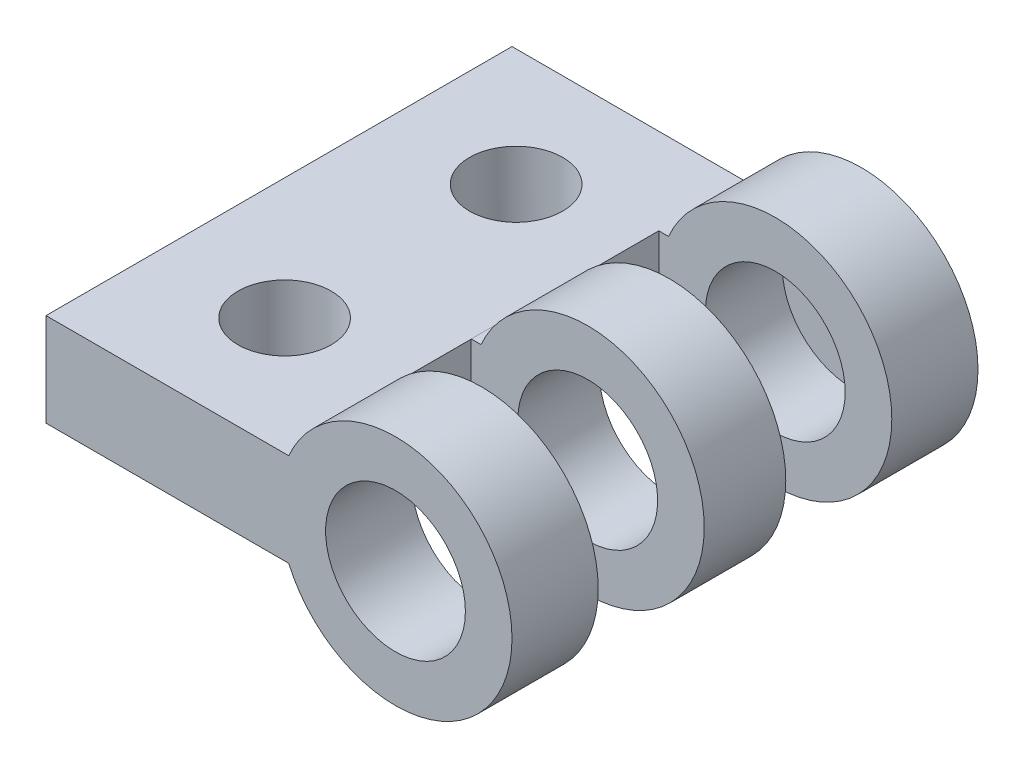
ISO-10303-21;
HEADER;
FILE_DESCRIPTION(('STEP AP214'),'2;1');
FILE_NAME('part.step','',(''),(''),'','','');
FILE_SCHEMA(('AUTOMOTIVE_DESIGN { 1 0 10303 214 1 1 1 1 }'));
ENDSEC;
DATA;
#1=APPLICATION_CONTEXT('core data for automotive mechanical design processes');
#2=APPLICATION_PROTOCOL_DEFINITION('international standard','automotive_design',2000,#1);
#3=PRODUCT_CONTEXT('',#1,'mechanical');
#4=PRODUCT('Part','Part','',(#3));
#5=PRODUCT_RELATED_PRODUCT_CATEGORY('part','',(#4));
#6=PRODUCT_DEFINITION_FORMATION('','',#4);
#7=PRODUCT_DEFINITION_CONTEXT('part definition',#1,'design');
#8=PRODUCT_DEFINITION('design','',#6,#7);
#9=PRODUCT_DEFINITION_SHAPE('','',#8);
#10=(LENGTH_UNIT() NAMED_UNIT(*) SI_UNIT(.MILLI.,.METRE.));
#11=(NAMED_UNIT(*) PLANE_ANGLE_UNIT() SI_UNIT($,.RADIAN.));
#12=(NAMED_UNIT(*) SI_UNIT($,.STERADIAN.) SOLID_ANGLE_UNIT());
#13=UNCERTAINTY_MEASURE_WITH_UNIT(LENGTH_MEASURE(1.E-05),#10,'distance_accuracy_value','');
#14=(GEOMETRIC_REPRESENTATION_CONTEXT(3) GLOBAL_UNCERTAINTY_ASSIGNED_CONTEXT((#13)) GLOBAL_UNIT_ASSIGNED_CONTEXT((#10,
#11,#12)) REPRESENTATION_CONTEXT('',''));
#15=CARTESIAN_POINT('',(0.,0.,0.));
#16=DIRECTION('',(0.,0.,1.));
#17=DIRECTION('',(1.,0.,0.));
#18=AXIS2_PLACEMENT_3D('',#15,#16,#17);
#19=CARTESIAN_POINT('',(0.,0.,1.95));
#20=DIRECTION('',(0.,0.,-1.));
#21=DIRECTION('',(-1.,0.,0.));
#22=AXIS2_PLACEMENT_3D('',#19,#20,#21);
#23=CYLINDRICAL_SURFACE('',#22,2.5);
#24=CARTESIAN_POINT('',(0.,0.,1.85));
#25=DIRECTION('',(0.,0.,1.));
#26=DIRECTION('',(1.,0.,0.));
#27=AXIS2_PLACEMENT_3D('',#24,#25,#26);
#28=CIRCLE('',#27,2.5);
#29=CARTESIAN_POINT('',(-2.29128784747792,-1.,1.85));
#30=VERTEX_POINT('',#29);
#31=CARTESIAN_POINT('',(-2.29128784747792,1.,1.85));
#32=VERTEX_POINT('',#31);
#33=EDGE_CURVE('E156',#30,#32,#28,.T.);
#34=ORIENTED_EDGE('',*,*,#33,.F.);
#35=DIRECTION('',(0.,0.,-1.));
#36=VECTOR('',#35,1.);
#37=CARTESIAN_POINT('',(-2.29128784747792,-1.,1.95));
#38=LINE('',#37,#36);
#39=CARTESIAN_POINT('',(-2.29128784747792,-1.,0.));
#40=VERTEX_POINT('',#39);
#41=EDGE_CURVE('E256',#30,#40,#38,.T.);
#42=ORIENTED_EDGE('',*,*,#41,.T.);
#43=CARTESIAN_POINT('',(0.,0.,0.));
#44=DIRECTION('',(0.,0.,1.));
#45=DIRECTION('',(1.,0.,0.));
#46=AXIS2_PLACEMENT_3D('',#43,#44,#45);
#47=CIRCLE('',#46,2.5);
#48=CARTESIAN_POINT('',(-2.29128784747792,1.,0.));
#49=VERTEX_POINT('',#48);
#50=EDGE_CURVE('E292',#40,#49,#47,.T.);
#51=ORIENTED_EDGE('',*,*,#50,.T.);
#52=DIRECTION('',(0.,0.,-1.));
#53=VECTOR('',#52,1.);
#54=CARTESIAN_POINT('',(-2.29128784747792,1.,1.95));
#55=LINE('',#54,#53);
#56=EDGE_CURVE('E289',#49,#32,#55,.F.);
#57=ORIENTED_EDGE('',*,*,#56,.T.);
#58=EDGE_LOOP('',(#34,#42,#51,#57));
#59=FACE_BOUND('',#58,.T.);
#60=ADVANCED_FACE('F42',(#59),#23,.T.);
#61=CARTESIAN_POINT('',(0.,0.,5.975));
#62=DIRECTION('',(0.,0.,-1.));
#63=DIRECTION('',(-1.,0.,0.));
#64=AXIS2_PLACEMENT_3D('',#61,#62,#63);
#65=CYLINDRICAL_SURFACE('',#64,2.5);
#66=DIRECTION('',(0.,0.,1.));
#67=VECTOR('',#66,1.);
#68=CARTESIAN_POINT('',(-2.29128784747792,-1.,8.05));
#69=LINE('',#68,#67);
#70=CARTESIAN_POINT('',(-2.29128784747792,-1.,4.125));
#71=VERTEX_POINT('',#70);
#72=CARTESIAN_POINT('',(-2.29128784747792,-1.,5.875));
#73=VERTEX_POINT('',#72);
#74=EDGE_CURVE('E253',#71,#73,#69,.T.);
#75=ORIENTED_EDGE('',*,*,#74,.F.);
#76=CARTESIAN_POINT('',(0.,0.,4.125));
#77=DIRECTION('',(0.,0.,1.));
#78=DIRECTION('',(1.,0.,0.));
#79=AXIS2_PLACEMENT_3D('',#76,#77,#78);
#80=CIRCLE('',#79,2.5);
#81=CARTESIAN_POINT('',(-2.29003079221331,1.00287535153422,4.125));
#82=VERTEX_POINT('',#81);
#83=EDGE_CURVE('E172',#82,#71,#80,.F.);
#84=ORIENTED_EDGE('',*,*,#83,.F.);
#85=DIRECTION('',(0.,0.,1.));
#86=VECTOR('',#85,1.);
#87=CARTESIAN_POINT('',(-2.29003079221331,1.00287535153422,8.05));
#88=LINE('',#87,#86);
#89=CARTESIAN_POINT('',(-2.29003079221331,1.00287535153422,5.875));
#90=VERTEX_POINT('',#89);
#91=EDGE_CURVE('E245',#90,#82,#88,.F.);
#92=ORIENTED_EDGE('',*,*,#91,.F.);
#93=CARTESIAN_POINT('',(0.,0.,5.875));
#94=DIRECTION('',(0.,0.,-1.));
#95=DIRECTION('',(-1.,0.,0.));
#96=AXIS2_PLACEMENT_3D('',#93,#94,#95);
#97=CIRCLE('',#96,2.5);
#98=EDGE_CURVE('E188',#73,#90,#97,.F.);
#99=ORIENTED_EDGE('',*,*,#98,.F.);
#100=EDGE_LOOP('',(#75,#84,#92,#99));
#101=FACE_BOUND('',#100,.T.);
#102=ADVANCED_FACE('F330',(#101),#65,.T.);
#103=CARTESIAN_POINT('',(-2.5,-1.,0.));
#104=DIRECTION('',(1.,0.,0.));
#105=DIRECTION('',(0.,0.,-1.));
#106=AXIS2_PLACEMENT_3D('',#103,#104,#105);
#107=PLANE('',#106);
#108=DIRECTION('',(0.,0.,-1.));
#109=VECTOR('',#108,1.);
#110=CARTESIAN_POINT('',(-2.5,1.,0.));
#111=LINE('',#110,#109);
#112=CARTESIAN_POINT('',(-2.5,1.,8.15));
#113=VERTEX_POINT('',#112);
#114=CARTESIAN_POINT('',(-2.5,1.,5.875));
#115=VERTEX_POINT('',#114);
#116=EDGE_CURVE('E149',#113,#115,#111,.T.);
#117=ORIENTED_EDGE('',*,*,#116,.F.);
#118=DIRECTION('',(0.,1.,0.));
#119=VECTOR('',#118,1.);
#120=CARTESIAN_POINT('',(-2.5,2.74000558746575,8.15));
#121=LINE('',#120,#119);
#122=CARTESIAN_POINT('',(-2.5,-1.,8.15));
#123=VERTEX_POINT('',#122);
#124=EDGE_CURVE('E199',#123,#113,#121,.T.);
#125=ORIENTED_EDGE('',*,*,#124,.F.);
#126=DIRECTION('',(0.,0.,-1.));
#127=VECTOR('',#126,1.);
#128=CARTESIAN_POINT('',(-2.5,-1.,0.));
#129=LINE('',#128,#127);
#130=CARTESIAN_POINT('',(-2.5,-1.,5.875));
#131=VERTEX_POINT('',#130);
#132=EDGE_CURVE('E274',#123,#131,#129,.T.);
#133=ORIENTED_EDGE('',*,*,#132,.T.);
#134=DIRECTION('',(0.,-1.,0.));
#135=VECTOR('',#134,1.);
#136=CARTESIAN_POINT('',(-2.5,2.60546008413663,5.875));
#137=LINE('',#136,#135);
#138=EDGE_CURVE('E183',#115,#131,#137,.T.);
#139=ORIENTED_EDGE('',*,*,#138,.F.);
#140=EDGE_LOOP('',(#117,#125,#133,#139));
#141=FACE_BOUND('',#140,.T.);
#142=ADVANCED_FACE('F342',(#141),#107,.T.);
#143=CARTESIAN_POINT('',(0.,0.,8.05));
#144=DIRECTION('',(0.,0.,1.));
#145=DIRECTION('',(1.,0.,0.));
#146=AXIS2_PLACEMENT_3D('',#143,#144,#145);
#147=CYLINDRICAL_SURFACE('',#146,2.5);
#148=CARTESIAN_POINT('',(0.,0.,8.15));
#149=DIRECTION('',(0.,0.,1.));
#150=DIRECTION('',(1.,0.,0.));
#151=AXIS2_PLACEMENT_3D('',#148,#149,#150);
#152=CIRCLE('',#151,2.5);
#153=CARTESIAN_POINT('',(-2.29128784747792,1.,8.15));
#154=VERTEX_POINT('',#153);
#155=CARTESIAN_POINT('',(-2.29128784747792,-1.,8.15));
#156=VERTEX_POINT('',#155);
#157=EDGE_CURVE('E208',#154,#156,#152,.F.);
#158=ORIENTED_EDGE('',*,*,#157,.F.);
#159=DIRECTION('',(0.,0.,1.));
#160=VECTOR('',#159,1.);
#161=CARTESIAN_POINT('',(-2.29128784747792,1.,8.05));
#162=LINE('',#161,#160);
#163=CARTESIAN_POINT('',(-2.29128784747792,1.,10.));
#164=VERTEX_POINT('',#163);
#165=EDGE_CURVE('E228',#164,#154,#162,.F.);
#166=ORIENTED_EDGE('',*,*,#165,.F.);
#167=CARTESIAN_POINT('',(0.,0.,10.));
#168=DIRECTION('',(0.,0.,1.));
#169=DIRECTION('',(1.,0.,0.));
#170=AXIS2_PLACEMENT_3D('',#167,#168,#169);
#171=CIRCLE('',#170,2.5);
#172=CARTESIAN_POINT('',(-2.29128784747792,-1.,10.));
#173=VERTEX_POINT('',#172);
#174=EDGE_CURVE('E237',#173,#164,#171,.T.);
#175=ORIENTED_EDGE('',*,*,#174,.F.);
#176=DIRECTION('',(0.,0.,1.));
#177=VECTOR('',#176,1.);
#178=CARTESIAN_POINT('',(-2.29128784747792,-1.,8.05));
#179=LINE('',#178,#177);
#180=EDGE_CURVE('E241',#156,#173,#179,.T.);
#181=ORIENTED_EDGE('',*,*,#180,.F.);
#182=EDGE_LOOP('',(#158,#166,#175,#181));
#183=FACE_BOUND('',#182,.T.);
#184=ADVANCED_FACE('F347',(#183),#147,.T.);
#185=CARTESIAN_POINT('',(-2.5,1.,4.125));
#186=VERTEX_POINT('',#185);
#187=CARTESIAN_POINT('',(-2.5,1.,1.85));
#188=VERTEX_POINT('',#187);
#189=EDGE_CURVE('E140',#186,#188,#111,.T.);
#190=ORIENTED_EDGE('',*,*,#189,.F.);
#191=DIRECTION('',(0.,1.,0.));
#192=VECTOR('',#191,1.);
#193=CARTESIAN_POINT('',(-2.5,2.5,4.125));
#194=LINE('',#193,#192);
#195=CARTESIAN_POINT('',(-2.5,-1.,4.125));
#196=VERTEX_POINT('',#195);
#197=EDGE_CURVE('E171',#196,#186,#194,.T.);
#198=ORIENTED_EDGE('',*,*,#197,.F.);
#199=CARTESIAN_POINT('',(-2.5,-1.,1.85));
#200=VERTEX_POINT('',#199);
#201=EDGE_CURVE('E57',#196,#200,#129,.T.);
#202=ORIENTED_EDGE('',*,*,#201,.T.);
#203=DIRECTION('',(0.,-1.,0.));
#204=VECTOR('',#203,1.);
#205=CARTESIAN_POINT('',(-2.5,2.76258699038665,1.85));
#206=LINE('',#205,#204);
#207=EDGE_CURVE('E154',#188,#200,#206,.T.);
#208=ORIENTED_EDGE('',*,*,#207,.F.);
#209=EDGE_LOOP('',(#190,#198,#202,#208));
#210=FACE_BOUND('',#209,.T.);
#211=ADVANCED_FACE('F160',(#210),#107,.T.);
#212=CARTESIAN_POINT('',(0.,0.,0.));
#213=DIRECTION('',(0.,0.,1.));
#214=DIRECTION('',(1.,0.,0.));
#215=AXIS2_PLACEMENT_3D('',#212,#213,#214);
#216=PLANE('',#215);
#217=ORIENTED_EDGE('',*,*,#50,.F.);
#218=DIRECTION('',(-1.,0.,0.));
#219=VECTOR('',#218,1.);
#220=CARTESIAN_POINT('',(-7.5,-1.,0.));
#221=LINE('',#220,#219);
#222=CARTESIAN_POINT('',(-7.5,-1.,0.));
#223=VERTEX_POINT('',#222);
#224=EDGE_CURVE('E277',#40,#223,#221,.T.);
#225=ORIENTED_EDGE('',*,*,#224,.T.);
#226=DIRECTION('',(0.,1.,0.));
#227=VECTOR('',#226,1.);
#228=CARTESIAN_POINT('',(-7.5,-1.,0.));
#229=LINE('',#228,#227);
#230=CARTESIAN_POINT('',(-7.5,1.,0.));
#231=VERTEX_POINT('',#230);
#232=EDGE_CURVE('E282',#223,#231,#229,.T.);
#233=ORIENTED_EDGE('',*,*,#232,.T.);
#234=DIRECTION('',(-1.,0.,0.));
#235=VECTOR('',#234,1.);
#236=CARTESIAN_POINT('',(2.501,1.,0.));
#237=LINE('',#236,#235);
#238=EDGE_CURVE('E286',#49,#231,#237,.T.);
#239=ORIENTED_EDGE('',*,*,#238,.F.);
#240=EDGE_LOOP('',(#217,#225,#233,#239));
#241=FACE_BOUND('',#240,.T.);
#242=ADVANCED_FACE('F360',(#241),#216,.F.);
#243=CARTESIAN_POINT('',(2.501,1.,1.95));
#244=DIRECTION('',(0.,-1.,0.));
#245=DIRECTION('',(0.,0.,-1.));
#246=AXIS2_PLACEMENT_3D('',#243,#244,#245);
#247=PLANE('',#246);
#248=CARTESIAN_POINT('',(-4.89564392373896,1.,7.48422319895814));
#249=DIRECTION('',(0.,1.,0.));
#250=DIRECTION('',(0.,0.,1.));
#251=AXIS2_PLACEMENT_3D('',#248,#249,#250);
#252=CIRCLE('',#251,1.);
#253=CARTESIAN_POINT('',(-4.89564392373896,1.,8.48422319895814));
#254=VERTEX_POINT('',#253);
#255=EDGE_CURVE('E216',#254,#254,#252,.T.);
#256=ORIENTED_EDGE('',*,*,#255,.F.);
#257=EDGE_LOOP('',(#256));
#258=FACE_BOUND('',#257,.T.);
#259=CARTESIAN_POINT('',(-4.89564392373896,1.,2.51577680104186));
#260=DIRECTION('',(0.,1.,0.));
#261=DIRECTION('',(0.,0.,-1.));
#262=AXIS2_PLACEMENT_3D('',#259,#260,#261);
#263=CIRCLE('',#262,1.);
#264=CARTESIAN_POINT('',(-4.89564392373896,1.,1.51577680104186));
#265=VERTEX_POINT('',#264);
#266=EDGE_CURVE('E215',#265,#265,#263,.T.);
#267=ORIENTED_EDGE('',*,*,#266,.F.);
#268=EDGE_LOOP('',(#267));
#269=FACE_BOUND('',#268,.T.);
#270=ORIENTED_EDGE('',*,*,#189,.T.);
#271=DIRECTION('',(-1.,0.,0.));
#272=VECTOR('',#271,1.);
#273=CARTESIAN_POINT('',(2.501,1.,1.85));
#274=LINE('',#273,#272);
#275=EDGE_CURVE('E144',#32,#188,#274,.T.);
#276=ORIENTED_EDGE('',*,*,#275,.F.);
#277=ORIENTED_EDGE('',*,*,#56,.F.);
#278=ORIENTED_EDGE('',*,*,#238,.T.);
#279=DIRECTION('',(0.,0.,1.));
#280=VECTOR('',#279,1.);
#281=CARTESIAN_POINT('',(-7.5,1.,0.));
#282=LINE('',#281,#280);
#283=CARTESIAN_POINT('',(-7.5,1.,10.));
#284=VERTEX_POINT('',#283);
#285=EDGE_CURVE('E259',#231,#284,#282,.T.);
#286=ORIENTED_EDGE('',*,*,#285,.T.);
#287=DIRECTION('',(1.,0.,0.));
#288=VECTOR('',#287,1.);
#289=CARTESIAN_POINT('',(-7.5,1.,10.));
#290=LINE('',#289,#288);
#291=EDGE_CURVE('E150',#284,#164,#290,.T.);
#292=ORIENTED_EDGE('',*,*,#291,.T.);
#293=ORIENTED_EDGE('',*,*,#165,.T.);
#294=DIRECTION('',(-1.,0.,0.));
#295=VECTOR('',#294,1.);
#296=CARTESIAN_POINT('',(2.501,1.,8.15));
#297=LINE('',#296,#295);
#298=EDGE_CURVE('E211',#154,#113,#297,.T.);
#299=ORIENTED_EDGE('',*,*,#298,.T.);
#300=ORIENTED_EDGE('',*,*,#116,.T.);
#301=DIRECTION('',(0.,0.,1.));
#302=VECTOR('',#301,1.);
#303=CARTESIAN_POINT('',(-2.5,1.,1.95));
#304=LINE('',#303,#302);
#305=EDGE_CURVE('E147',#186,#115,#304,.T.);
#306=ORIENTED_EDGE('',*,*,#305,.F.);
#307=EDGE_LOOP('',(#270,#276,#277,#278,#286,#292,#293,#299,#300,#306));
#308=FACE_BOUND('',#307,.T.);
#309=ADVANCED_FACE('F142',(#258,#269,#308),#247,.F.);
#310=CARTESIAN_POINT('',(-7.5,-1.,0.));
#311=DIRECTION('',(-1.,0.,0.));
#312=DIRECTION('',(0.,0.,1.));
#313=AXIS2_PLACEMENT_3D('',#310,#311,#312);
#314=PLANE('',#313);
#315=DIRECTION('',(0.,1.,0.));
#316=VECTOR('',#315,1.);
#317=CARTESIAN_POINT('',(-7.5,-1.,10.));
#318=LINE('',#317,#316);
#319=CARTESIAN_POINT('',(-7.5,-1.,10.));
#320=VERTEX_POINT('',#319);
#321=EDGE_CURVE('E281',#320,#284,#318,.T.);
#322=ORIENTED_EDGE('',*,*,#321,.T.);
#323=ORIENTED_EDGE('',*,*,#285,.F.);
#324=ORIENTED_EDGE('',*,*,#232,.F.);
#325=DIRECTION('',(0.,0.,1.));
#326=VECTOR('',#325,1.);
#327=CARTESIAN_POINT('',(-7.5,-1.,0.));
#328=LINE('',#327,#326);
#329=EDGE_CURVE('E266',#223,#320,#328,.T.);
#330=ORIENTED_EDGE('',*,*,#329,.T.);
#331=EDGE_LOOP('',(#322,#323,#324,#330));
#332=FACE_BOUND('',#331,.T.);
#333=ADVANCED_FACE('F355',(#332),#314,.T.);
#334=CARTESIAN_POINT('',(-7.5,-1.,10.));
#335=DIRECTION('',(0.,0.,1.));
#336=DIRECTION('',(1.,0.,0.));
#337=AXIS2_PLACEMENT_3D('',#334,#335,#336);
#338=PLANE('',#337);
#339=ORIENTED_EDGE('',*,*,#174,.T.);
#340=ORIENTED_EDGE('',*,*,#291,.F.);
#341=ORIENTED_EDGE('',*,*,#321,.F.);
#342=DIRECTION('',(1.,0.,0.));
#343=VECTOR('',#342,1.);
#344=CARTESIAN_POINT('',(-7.5,-1.,10.));
#345=LINE('',#344,#343);
#346=EDGE_CURVE('E270',#320,#173,#345,.T.);
#347=ORIENTED_EDGE('',*,*,#346,.T.);
#348=EDGE_LOOP('',(#339,#340,#341,#347));
#349=FACE_BOUND('',#348,.T.);
#350=CARTESIAN_POINT('',(0.,0.,10.));
#351=DIRECTION('',(0.,0.,1.));
#352=DIRECTION('',(1.,0.,0.));
#353=AXIS2_PLACEMENT_3D('',#350,#351,#352);
#354=CIRCLE('',#353,1.5);
#355=CARTESIAN_POINT('',(1.5,0.,10.));
#356=VERTEX_POINT('',#355);
#357=EDGE_CURVE('E233',#356,#356,#354,.T.);
#358=ORIENTED_EDGE('',*,*,#357,.F.);
#359=EDGE_LOOP('',(#358));
#360=FACE_BOUND('',#359,.T.);
#361=ADVANCED_FACE('F349',(#349,#360),#338,.T.);
#362=CARTESIAN_POINT('',(0.,-1.,0.));
#363=DIRECTION('',(0.,1.,0.));
#364=DIRECTION('',(0.,0.,1.));
#365=AXIS2_PLACEMENT_3D('',#362,#363,#364);
#366=PLANE('',#365);
#367=CARTESIAN_POINT('',(-4.89564392373896,-1.,7.48422319895814));
#368=DIRECTION('',(0.,1.,0.));
#369=DIRECTION('',(0.,0.,1.));
#370=AXIS2_PLACEMENT_3D('',#367,#368,#369);
#371=CIRCLE('',#370,1.);
#372=CARTESIAN_POINT('',(-4.89564392373896,-1.,8.48422319895814));
#373=VERTEX_POINT('',#372);
#374=EDGE_CURVE('E229',#373,#373,#371,.T.);
#375=ORIENTED_EDGE('',*,*,#374,.T.);
#376=EDGE_LOOP('',(#375));
#377=FACE_BOUND('',#376,.T.);
#378=CARTESIAN_POINT('',(-4.89564392373896,-1.,2.51577680104186));
#379=DIRECTION('',(0.,1.,0.));
#380=DIRECTION('',(0.,0.,1.));
#381=AXIS2_PLACEMENT_3D('',#378,#379,#380);
#382=CIRCLE('',#381,1.);
#383=CARTESIAN_POINT('',(-4.89564392373896,-1.,3.51577680104186));
#384=VERTEX_POINT('',#383);
#385=EDGE_CURVE('E220',#384,#384,#382,.T.);
#386=ORIENTED_EDGE('',*,*,#385,.T.);
#387=EDGE_LOOP('',(#386));
#388=FACE_BOUND('',#387,.T.);
#389=DIRECTION('',(1.,0.,0.));
#390=VECTOR('',#389,1.);
#391=CARTESIAN_POINT('',(0.,-1.,1.85));
#392=LINE('',#391,#390);
#393=EDGE_CURVE('E11',#200,#30,#392,.T.);
#394=ORIENTED_EDGE('',*,*,#393,.F.);
#395=ORIENTED_EDGE('',*,*,#201,.F.);
#396=DIRECTION('',(1.,0.,0.));
#397=VECTOR('',#396,1.);
#398=CARTESIAN_POINT('',(0.,-1.,4.125));
#399=LINE('',#398,#397);
#400=EDGE_CURVE('E175',#196,#71,#399,.T.);
#401=ORIENTED_EDGE('',*,*,#400,.T.);
#402=ORIENTED_EDGE('',*,*,#74,.T.);
#403=DIRECTION('',(-1.,0.,0.));
#404=VECTOR('',#403,1.);
#405=CARTESIAN_POINT('',(0.,-1.,5.875));
#406=LINE('',#405,#404);
#407=EDGE_CURVE('E191',#73,#131,#406,.T.);
#408=ORIENTED_EDGE('',*,*,#407,.T.);
#409=ORIENTED_EDGE('',*,*,#132,.F.);
#410=DIRECTION('',(1.,0.,0.));
#411=VECTOR('',#410,1.);
#412=CARTESIAN_POINT('',(0.,-1.,8.15));
#413=LINE('',#412,#411);
#414=EDGE_CURVE('E204',#123,#156,#413,.T.);
#415=ORIENTED_EDGE('',*,*,#414,.T.);
#416=ORIENTED_EDGE('',*,*,#180,.T.);
#417=ORIENTED_EDGE('',*,*,#346,.F.);
#418=ORIENTED_EDGE('',*,*,#329,.F.);
#419=ORIENTED_EDGE('',*,*,#224,.F.);
#420=ORIENTED_EDGE('',*,*,#41,.F.);
#421=EDGE_LOOP('',(#394,#395,#401,#402,#408,#409,#415,#416,#417,#418,#419,#420));
#422=FACE_BOUND('',#421,.T.);
#423=ADVANCED_FACE('F327',(#377,#388,#422),#366,.F.);
#424=CARTESIAN_POINT('',(0.,0.,5.975));
#425=DIRECTION('',(0.,0.,-1.));
#426=DIRECTION('',(-1.,0.,0.));
#427=AXIS2_PLACEMENT_3D('',#424,#425,#426);
#428=CYLINDRICAL_SURFACE('',#427,1.5);
#429=CARTESIAN_POINT('',(0.,0.,4.125));
#430=DIRECTION('',(0.,0.,1.));
#431=DIRECTION('',(1.,0.,0.));
#432=AXIS2_PLACEMENT_3D('',#429,#430,#431);
#433=CIRCLE('',#432,1.5);
#434=CARTESIAN_POINT('',(1.5,0.,4.125));
#435=VERTEX_POINT('',#434);
#436=EDGE_CURVE('E179',#435,#435,#433,.F.);
#437=ORIENTED_EDGE('',*,*,#436,.T.);
#438=EDGE_LOOP('',(#437));
#439=FACE_BOUND('',#438,.T.);
#440=CARTESIAN_POINT('',(0.,0.,5.875));
#441=DIRECTION('',(0.,0.,-1.));
#442=DIRECTION('',(-1.,0.,0.));
#443=AXIS2_PLACEMENT_3D('',#440,#441,#442);
#444=CIRCLE('',#443,1.5);
#445=CARTESIAN_POINT('',(-1.5,0.,5.875));
#446=VERTEX_POINT('',#445);
#447=EDGE_CURVE('E195',#446,#446,#444,.F.);
#448=ORIENTED_EDGE('',*,*,#447,.T.);
#449=EDGE_LOOP('',(#448));
#450=FACE_BOUND('',#449,.T.);
#451=ADVANCED_FACE('F378',(#439,#450),#428,.F.);
#452=CARTESIAN_POINT('',(-2.5,0.,0.));
#453=DIRECTION('',(1.,0.,0.));
#454=DIRECTION('',(0.,0.,-1.));
#455=AXIS2_PLACEMENT_3D('',#452,#453,#454);
#456=PLANE('',#455);
#457=DIRECTION('',(0.,0.,1.));
#458=VECTOR('',#457,1.);
#459=CARTESIAN_POINT('',(-2.5,1.00287535153422,5.975));
#460=LINE('',#459,#458);
#461=CARTESIAN_POINT('',(-2.5,1.00287535153422,4.125));
#462=VERTEX_POINT('',#461);
#463=CARTESIAN_POINT('',(-2.5,1.00287535153422,5.875));
#464=VERTEX_POINT('',#463);
#465=EDGE_CURVE('E244',#462,#464,#460,.T.);
#466=ORIENTED_EDGE('',*,*,#465,.F.);
#467=EDGE_CURVE('E65',#186,#462,#194,.T.);
#468=ORIENTED_EDGE('',*,*,#467,.F.);
#469=ORIENTED_EDGE('',*,*,#305,.T.);
#470=EDGE_CURVE('E187',#464,#115,#137,.T.);
#471=ORIENTED_EDGE('',*,*,#470,.F.);
#472=EDGE_LOOP('',(#466,#468,#469,#471));
#473=FACE_BOUND('',#472,.T.);
#474=ADVANCED_FACE('F317',(#473),#456,.F.);
#475=CARTESIAN_POINT('',(2.501,1.00287535153422,5.975));
#476=DIRECTION('',(0.,-1.,0.));
#477=DIRECTION('',(0.,0.,-1.));
#478=AXIS2_PLACEMENT_3D('',#475,#476,#477);
#479=PLANE('',#478);
#480=ORIENTED_EDGE('',*,*,#91,.T.);
#481=DIRECTION('',(-1.,0.,0.));
#482=VECTOR('',#481,1.);
#483=CARTESIAN_POINT('',(2.501,1.00287535153422,4.125));
#484=LINE('',#483,#482);
#485=EDGE_CURVE('E50',#82,#462,#484,.T.);
#486=ORIENTED_EDGE('',*,*,#485,.T.);
#487=ORIENTED_EDGE('',*,*,#465,.T.);
#488=DIRECTION('',(1.,0.,0.));
#489=VECTOR('',#488,1.);
#490=CARTESIAN_POINT('',(2.501,1.00287535153422,5.875));
#491=LINE('',#490,#489);
#492=EDGE_CURVE('E297',#464,#90,#491,.T.);
#493=ORIENTED_EDGE('',*,*,#492,.T.);
#494=EDGE_LOOP('',(#480,#486,#487,#493));
#495=FACE_BOUND('',#494,.T.);
#496=ADVANCED_FACE('F312',(#495),#479,.F.);
#497=CARTESIAN_POINT('',(0.,0.,8.05));
#498=DIRECTION('',(0.,0.,1.));
#499=DIRECTION('',(1.,0.,0.));
#500=AXIS2_PLACEMENT_3D('',#497,#498,#499);
#501=CYLINDRICAL_SURFACE('',#500,1.5);
#502=CARTESIAN_POINT('',(0.,0.,8.15));
#503=DIRECTION('',(0.,0.,1.));
#504=DIRECTION('',(1.,0.,0.));
#505=AXIS2_PLACEMENT_3D('',#502,#503,#504);
#506=CIRCLE('',#505,1.5);
#507=CARTESIAN_POINT('',(1.5,0.,8.15));
#508=VERTEX_POINT('',#507);
#509=EDGE_CURVE('E203',#508,#508,#506,.F.);
#510=ORIENTED_EDGE('',*,*,#509,.T.);
#511=EDGE_LOOP('',(#510));
#512=FACE_BOUND('',#511,.T.);
#513=ORIENTED_EDGE('',*,*,#357,.T.);
#514=EDGE_LOOP('',(#513));
#515=FACE_BOUND('',#514,.T.);
#516=ADVANCED_FACE('F453',(#512,#515),#501,.F.);
#517=CARTESIAN_POINT('',(-4.89564392373896,-9.,2.51577680104186));
#518=DIRECTION('',(0.,1.,0.));
#519=DIRECTION('',(0.,0.,1.));
#520=AXIS2_PLACEMENT_3D('',#517,#518,#519);
#521=CYLINDRICAL_SURFACE('',#520,1.);
#522=ORIENTED_EDGE('',*,*,#266,.T.);
#523=EDGE_LOOP('',(#522));
#524=FACE_BOUND('',#523,.T.);
#525=ORIENTED_EDGE('',*,*,#385,.F.);
#526=EDGE_LOOP('',(#525));
#527=FACE_BOUND('',#526,.T.);
#528=ADVANCED_FACE('F462',(#524,#527),#521,.F.);
#529=CARTESIAN_POINT('',(-4.89564392373896,-9.,7.48422319895814));
#530=DIRECTION('',(0.,1.,0.));
#531=DIRECTION('',(0.,0.,1.));
#532=AXIS2_PLACEMENT_3D('',#529,#530,#531);
#533=CYLINDRICAL_SURFACE('',#532,1.);
#534=ORIENTED_EDGE('',*,*,#255,.T.);
#535=EDGE_LOOP('',(#534));
#536=FACE_BOUND('',#535,.T.);
#537=ORIENTED_EDGE('',*,*,#374,.F.);
#538=EDGE_LOOP('',(#537));
#539=FACE_BOUND('',#538,.T.);
#540=ADVANCED_FACE('F479',(#536,#539),#533,.F.);
#541=CARTESIAN_POINT('',(0.,0.,8.15));
#542=DIRECTION('',(0.,0.,1.));
#543=DIRECTION('',(1.,0.,0.));
#544=AXIS2_PLACEMENT_3D('',#541,#542,#543);
#545=PLANE('',#544);
#546=ORIENTED_EDGE('',*,*,#509,.F.);
#547=EDGE_LOOP('',(#546));
#548=FACE_BOUND('',#547,.T.);
#549=ORIENTED_EDGE('',*,*,#298,.F.);
#550=ORIENTED_EDGE('',*,*,#157,.T.);
#551=ORIENTED_EDGE('',*,*,#414,.F.);
#552=ORIENTED_EDGE('',*,*,#124,.T.);
#553=EDGE_LOOP('',(#549,#550,#551,#552));
#554=FACE_BOUND('',#553,.T.);
#555=ADVANCED_FACE('F341',(#548,#554),#545,.F.);
#556=CARTESIAN_POINT('',(0.,0.,5.875));
#557=DIRECTION('',(0.,0.,-1.));
#558=DIRECTION('',(-1.,0.,0.));
#559=AXIS2_PLACEMENT_3D('',#556,#557,#558);
#560=PLANE('',#559);
#561=ORIENTED_EDGE('',*,*,#407,.F.);
#562=ORIENTED_EDGE('',*,*,#98,.T.);
#563=ORIENTED_EDGE('',*,*,#492,.F.);
#564=ORIENTED_EDGE('',*,*,#470,.T.);
#565=ORIENTED_EDGE('',*,*,#138,.T.);
#566=EDGE_LOOP('',(#561,#562,#563,#564,#565));
#567=FACE_BOUND('',#566,.T.);
#568=ORIENTED_EDGE('',*,*,#447,.F.);
#569=EDGE_LOOP('',(#568));
#570=FACE_BOUND('',#569,.T.);
#571=ADVANCED_FACE('F332',(#567,#570),#560,.F.);
#572=CARTESIAN_POINT('',(0.,0.,4.125));
#573=DIRECTION('',(0.,0.,1.));
#574=DIRECTION('',(1.,0.,0.));
#575=AXIS2_PLACEMENT_3D('',#572,#573,#574);
#576=PLANE('',#575);
#577=ORIENTED_EDGE('',*,*,#197,.T.);
#578=ORIENTED_EDGE('',*,*,#467,.T.);
#579=ORIENTED_EDGE('',*,*,#485,.F.);
#580=ORIENTED_EDGE('',*,*,#83,.T.);
#581=ORIENTED_EDGE('',*,*,#400,.F.);
#582=EDGE_LOOP('',(#577,#578,#579,#580,#581));
#583=FACE_BOUND('',#582,.T.);
#584=ORIENTED_EDGE('',*,*,#436,.F.);
#585=EDGE_LOOP('',(#584));
#586=FACE_BOUND('',#585,.T.);
#587=ADVANCED_FACE('F323',(#583,#586),#576,.F.);
#588=CARTESIAN_POINT('',(0.,0.,1.85));
#589=DIRECTION('',(0.,0.,1.));
#590=DIRECTION('',(1.,0.,0.));
#591=AXIS2_PLACEMENT_3D('',#588,#589,#590);
#592=PLANE('',#591);
#593=CARTESIAN_POINT('',(0.,0.,1.85));
#594=DIRECTION('',(0.,0.,1.));
#595=DIRECTION('',(1.,0.,0.));
#596=AXIS2_PLACEMENT_3D('',#593,#594,#595);
#597=CIRCLE('',#596,1.5);
#598=CARTESIAN_POINT('',(1.5,0.,1.85));
#599=VERTEX_POINT('',#598);
#600=EDGE_CURVE('E158',#599,#599,#597,.T.);
#601=ORIENTED_EDGE('',*,*,#600,.F.);
#602=EDGE_LOOP('',(#601));
#603=FACE_BOUND('',#602,.T.);
#604=ORIENTED_EDGE('',*,*,#275,.T.);
#605=ORIENTED_EDGE('',*,*,#207,.T.);
#606=ORIENTED_EDGE('',*,*,#393,.T.);
#607=ORIENTED_EDGE('',*,*,#33,.T.);
#608=EDGE_LOOP('',(#604,#605,#606,#607));
#609=FACE_BOUND('',#608,.T.);
#610=ADVANCED_FACE('F153',(#603,#609),#592,.T.);
#611=CARTESIAN_POINT('',(0.,0.,0.2));
#612=DIRECTION('',(0.,0.,-1.));
#613=DIRECTION('',(-1.,0.,0.));
#614=AXIS2_PLACEMENT_3D('',#611,#612,#613);
#615=PLANE('',#614);
#616=CARTESIAN_POINT('',(0.,0.,0.2));
#617=DIRECTION('',(0.,0.,-1.));
#618=DIRECTION('',(-1.,0.,0.));
#619=AXIS2_PLACEMENT_3D('',#616,#617,#618);
#620=CIRCLE('',#619,1.5);
#621=CARTESIAN_POINT('',(-1.5,0.,0.2));
#622=VERTEX_POINT('',#621);
#623=EDGE_CURVE('E224',#622,#622,#620,.T.);
#624=ORIENTED_EDGE('',*,*,#623,.F.);
#625=EDGE_LOOP('',(#624));
#626=FACE_BOUND('',#625,.T.);
#627=ADVANCED_FACE('F393',(#626),#615,.F.);
#628=CARTESIAN_POINT('',(0.,0.,1.95));
#629=DIRECTION('',(0.,0.,-1.));
#630=DIRECTION('',(-1.,0.,0.));
#631=AXIS2_PLACEMENT_3D('',#628,#629,#630);
#632=CYLINDRICAL_SURFACE('',#631,1.5);
#633=ORIENTED_EDGE('',*,*,#623,.T.);
#634=EDGE_LOOP('',(#633));
#635=FACE_BOUND('',#634,.T.);
#636=ORIENTED_EDGE('',*,*,#600,.T.);
#637=EDGE_LOOP('',(#636));
#638=FACE_BOUND('',#637,.T.);
#639=ADVANCED_FACE('F391',(#635,#638),#632,.F.);
#640=CLOSED_SHELL('',(#60,#102,#142,#184,#211,#242,#309,#333,#361,#423,#451,#474,#496,#516,#528,
#540,#555,#571,#587,#610,#627,#639));
#641=MANIFOLD_SOLID_BREP('B2',#640);
#642=ADVANCED_BREP_SHAPE_REPRESENTATION('',(#18,#641),#14);
#643=SHAPE_DEFINITION_REPRESENTATION(#9,#642);
ENDSEC;
END-ISO-10303-21;
